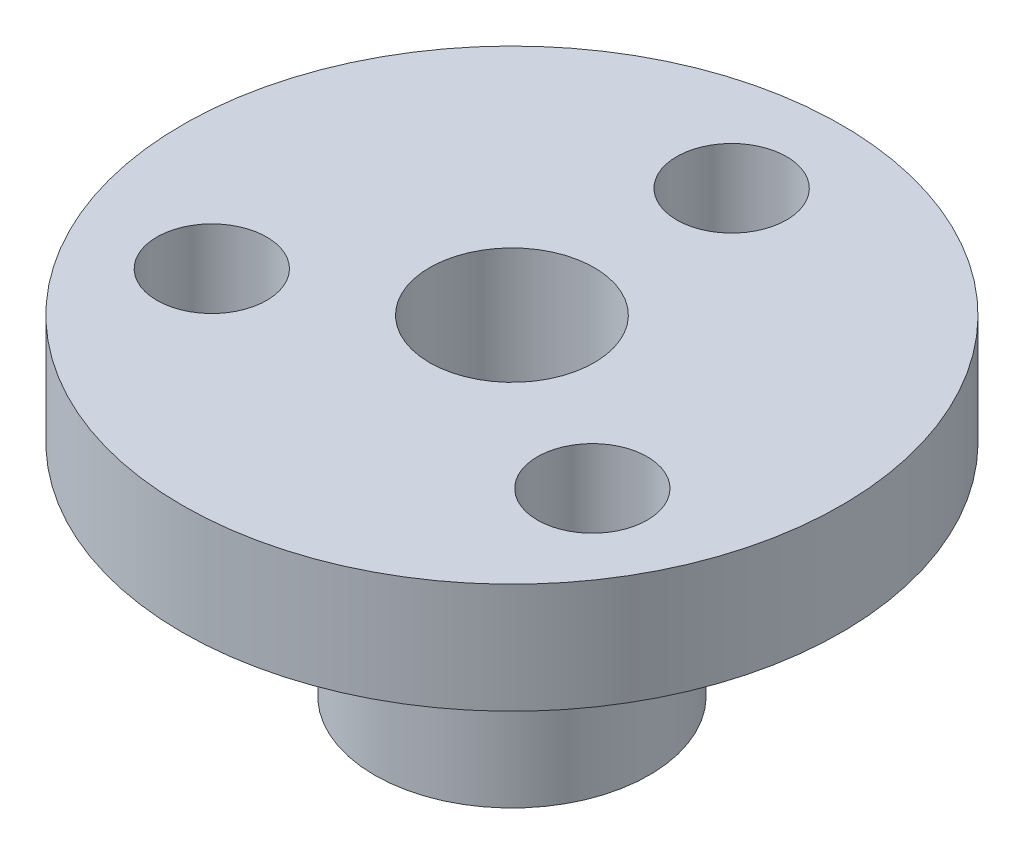
ISO-10303-21;
HEADER;
FILE_DESCRIPTION(('STEP AP214'),'2;1');
FILE_NAME('part.step','',(''),(''),'','','');
FILE_SCHEMA(('AUTOMOTIVE_DESIGN { 1 0 10303 214 1 1 1 1 }'));
ENDSEC;
DATA;
#1=APPLICATION_CONTEXT('core data for automotive mechanical design processes');
#2=APPLICATION_PROTOCOL_DEFINITION('international standard','automotive_design',2000,#1);
#3=PRODUCT_CONTEXT('',#1,'mechanical');
#4=PRODUCT('Part','Part','',(#3));
#5=PRODUCT_RELATED_PRODUCT_CATEGORY('part','',(#4));
#6=PRODUCT_DEFINITION_FORMATION('','',#4);
#7=PRODUCT_DEFINITION_CONTEXT('part definition',#1,'design');
#8=PRODUCT_DEFINITION('design','',#6,#7);
#9=PRODUCT_DEFINITION_SHAPE('','',#8);
#10=(LENGTH_UNIT() NAMED_UNIT(*) SI_UNIT(.MILLI.,.METRE.));
#11=(NAMED_UNIT(*) PLANE_ANGLE_UNIT() SI_UNIT($,.RADIAN.));
#12=(NAMED_UNIT(*) SI_UNIT($,.STERADIAN.) SOLID_ANGLE_UNIT());
#13=UNCERTAINTY_MEASURE_WITH_UNIT(LENGTH_MEASURE(1.E-05),#10,'distance_accuracy_value','');
#14=(GEOMETRIC_REPRESENTATION_CONTEXT(3) GLOBAL_UNCERTAINTY_ASSIGNED_CONTEXT((#13)) GLOBAL_UNIT_ASSIGNED_CONTEXT((#10,
#11,#12)) REPRESENTATION_CONTEXT('',''));
#15=CARTESIAN_POINT('',(0.,0.,0.));
#16=DIRECTION('',(0.,0.,1.));
#17=DIRECTION('',(1.,0.,0.));
#18=AXIS2_PLACEMENT_3D('',#15,#16,#17);
#19=CARTESIAN_POINT('',(0.,10.3404322573456,0.));
#20=DIRECTION('',(0.,1.,0.));
#21=DIRECTION('',(0.,0.,1.));
#22=AXIS2_PLACEMENT_3D('',#19,#20,#21);
#23=CYLINDRICAL_SURFACE('',#22,2.38);
#24=CARTESIAN_POINT('',(0.,0.,0.));
#25=DIRECTION('',(0.,1.,0.));
#26=DIRECTION('',(0.,0.,1.));
#27=AXIS2_PLACEMENT_3D('',#24,#25,#26);
#28=CIRCLE('',#27,2.38);
#29=CARTESIAN_POINT('',(0.,0.,2.38));
#30=VERTEX_POINT('',#29);
#31=EDGE_CURVE('E60',#30,#30,#28,.T.);
#32=ORIENTED_EDGE('',*,*,#31,.F.);
#33=EDGE_LOOP('',(#32));
#34=FACE_BOUND('',#33,.T.);
#35=CARTESIAN_POINT('',(0.,9.53,0.));
#36=DIRECTION('',(0.,1.,0.));
#37=DIRECTION('',(0.,0.,1.));
#38=AXIS2_PLACEMENT_3D('',#35,#36,#37);
#39=CIRCLE('',#38,2.38);
#40=CARTESIAN_POINT('',(0.,9.53,2.38));
#41=VERTEX_POINT('',#40);
#42=EDGE_CURVE('E10',#41,#41,#39,.T.);
#43=ORIENTED_EDGE('',*,*,#42,.T.);
#44=EDGE_LOOP('',(#43));
#45=FACE_BOUND('',#44,.T.);
#46=ADVANCED_FACE('F37',(#34,#45),#23,.F.);
#47=CARTESIAN_POINT('',(2.38,9.53,0.));
#48=DIRECTION('',(0.,-1.,0.));
#49=DIRECTION('',(0.,0.,-1.));
#50=AXIS2_PLACEMENT_3D('',#47,#48,#49);
#51=PLANE('',#50);
#52=CARTESIAN_POINT('',(-5.49926131403117,9.53,3.17500000000003));
#53=DIRECTION('',(0.,1.,0.));
#54=DIRECTION('',(0.866025403784436,0.,-0.500000000000004));
#55=AXIS2_PLACEMENT_3D('',#52,#53,#54);
#56=CIRCLE('',#55,1.5875);
#57=CARTESIAN_POINT('',(-4.12444598552338,9.53,2.38125000000002));
#58=VERTEX_POINT('',#57);
#59=EDGE_CURVE('E70',#58,#58,#56,.T.);
#60=ORIENTED_EDGE('',*,*,#59,.F.);
#61=EDGE_LOOP('',(#60));
#62=FACE_BOUND('',#61,.T.);
#63=CARTESIAN_POINT('',(5.49926131403121,9.53,3.17499999999995));
#64=DIRECTION('',(0.,1.,0.));
#65=DIRECTION('',(-0.866025403784443,0.,-0.499999999999992));
#66=AXIS2_PLACEMENT_3D('',#63,#64,#65);
#67=CIRCLE('',#66,1.5875);
#68=CARTESIAN_POINT('',(4.12444598552341,9.53,2.38124999999996));
#69=VERTEX_POINT('',#68);
#70=EDGE_CURVE('E71',#69,#69,#67,.T.);
#71=ORIENTED_EDGE('',*,*,#70,.F.);
#72=EDGE_LOOP('',(#71));
#73=FACE_BOUND('',#72,.T.);
#74=CARTESIAN_POINT('',(0.,9.53,-6.35));
#75=DIRECTION('',(0.,1.,0.));
#76=DIRECTION('',(0.,0.,1.));
#77=AXIS2_PLACEMENT_3D('',#74,#75,#76);
#78=CIRCLE('',#77,1.5875);
#79=CARTESIAN_POINT('',(0.,9.53,-4.7625));
#80=VERTEX_POINT('',#79);
#81=EDGE_CURVE('E63',#80,#80,#78,.T.);
#82=ORIENTED_EDGE('',*,*,#81,.F.);
#83=EDGE_LOOP('',(#82));
#84=FACE_BOUND('',#83,.T.);
#85=ORIENTED_EDGE('',*,*,#42,.F.);
#86=EDGE_LOOP('',(#85));
#87=FACE_BOUND('',#86,.T.);
#88=CARTESIAN_POINT('',(0.,9.53,0.));
#89=DIRECTION('',(0.,1.,0.));
#90=DIRECTION('',(0.,0.,1.));
#91=AXIS2_PLACEMENT_3D('',#88,#89,#90);
#92=CIRCLE('',#91,9.525);
#93=CARTESIAN_POINT('',(0.,9.53,9.525));
#94=VERTEX_POINT('',#93);
#95=EDGE_CURVE('E44',#94,#94,#92,.T.);
#96=ORIENTED_EDGE('',*,*,#95,.T.);
#97=EDGE_LOOP('',(#96));
#98=FACE_BOUND('',#97,.T.);
#99=ADVANCED_FACE('F82',(#62,#73,#84,#87,#98),#51,.F.);
#100=CARTESIAN_POINT('',(0.,10.3404322573456,0.));
#101=DIRECTION('',(0.,1.,0.));
#102=DIRECTION('',(0.,0.,1.));
#103=AXIS2_PLACEMENT_3D('',#100,#101,#102);
#104=CYLINDRICAL_SURFACE('',#103,9.525);
#105=ORIENTED_EDGE('',*,*,#95,.F.);
#106=EDGE_LOOP('',(#105));
#107=FACE_BOUND('',#106,.T.);
#108=CARTESIAN_POINT('',(0.,6.35,0.));
#109=DIRECTION('',(0.,1.,0.));
#110=DIRECTION('',(0.,0.,1.));
#111=AXIS2_PLACEMENT_3D('',#108,#109,#110);
#112=CIRCLE('',#111,9.525);
#113=CARTESIAN_POINT('',(0.,6.35,9.525));
#114=VERTEX_POINT('',#113);
#115=EDGE_CURVE('E48',#114,#114,#112,.T.);
#116=ORIENTED_EDGE('',*,*,#115,.T.);
#117=EDGE_LOOP('',(#116));
#118=FACE_BOUND('',#117,.T.);
#119=ADVANCED_FACE('F85',(#107,#118),#104,.T.);
#120=CARTESIAN_POINT('',(9.525,6.35,0.));
#121=DIRECTION('',(0.,1.,0.));
#122=DIRECTION('',(0.,0.,1.));
#123=AXIS2_PLACEMENT_3D('',#120,#121,#122);
#124=PLANE('',#123);
#125=CARTESIAN_POINT('',(-5.49926131403117,6.35,3.17500000000003));
#126=DIRECTION('',(0.,1.,0.));
#127=DIRECTION('',(0.866025403784436,0.,-0.500000000000004));
#128=AXIS2_PLACEMENT_3D('',#125,#126,#127);
#129=CIRCLE('',#128,1.5875);
#130=CARTESIAN_POINT('',(-4.12444598552338,6.35,2.38125000000002));
#131=VERTEX_POINT('',#130);
#132=EDGE_CURVE('E66',#131,#131,#129,.T.);
#133=ORIENTED_EDGE('',*,*,#132,.T.);
#134=EDGE_LOOP('',(#133));
#135=FACE_BOUND('',#134,.T.);
#136=CARTESIAN_POINT('',(5.49926131403121,6.35,3.17499999999995));
#137=DIRECTION('',(0.,1.,0.));
#138=DIRECTION('',(-0.866025403784443,0.,-0.499999999999992));
#139=AXIS2_PLACEMENT_3D('',#136,#137,#138);
#140=CIRCLE('',#139,1.5875);
#141=CARTESIAN_POINT('',(4.12444598552341,6.35,2.38124999999996));
#142=VERTEX_POINT('',#141);
#143=EDGE_CURVE('E67',#142,#142,#140,.T.);
#144=ORIENTED_EDGE('',*,*,#143,.T.);
#145=EDGE_LOOP('',(#144));
#146=FACE_BOUND('',#145,.T.);
#147=CARTESIAN_POINT('',(0.,6.35,-6.35));
#148=DIRECTION('',(0.,1.,0.));
#149=DIRECTION('',(0.,0.,1.));
#150=AXIS2_PLACEMENT_3D('',#147,#148,#149);
#151=CIRCLE('',#150,1.5875);
#152=CARTESIAN_POINT('',(0.,6.35,-4.7625));
#153=VERTEX_POINT('',#152);
#154=EDGE_CURVE('E40',#153,#153,#151,.T.);
#155=ORIENTED_EDGE('',*,*,#154,.T.);
#156=EDGE_LOOP('',(#155));
#157=FACE_BOUND('',#156,.T.);
#158=ORIENTED_EDGE('',*,*,#115,.F.);
#159=EDGE_LOOP('',(#158));
#160=FACE_BOUND('',#159,.T.);
#161=CARTESIAN_POINT('',(0.,6.35,0.));
#162=DIRECTION('',(0.,1.,0.));
#163=DIRECTION('',(0.,0.,1.));
#164=AXIS2_PLACEMENT_3D('',#161,#162,#163);
#165=CIRCLE('',#164,3.97);
#166=CARTESIAN_POINT('',(0.,6.35,3.97));
#167=VERTEX_POINT('',#166);
#168=EDGE_CURVE('E54',#167,#167,#165,.T.);
#169=ORIENTED_EDGE('',*,*,#168,.T.);
#170=EDGE_LOOP('',(#169));
#171=FACE_BOUND('',#170,.T.);
#172=ADVANCED_FACE('F95',(#135,#146,#157,#160,#171),#124,.F.);
#173=CARTESIAN_POINT('',(0.,10.3404322573456,0.));
#174=DIRECTION('',(0.,1.,0.));
#175=DIRECTION('',(0.,0.,1.));
#176=AXIS2_PLACEMENT_3D('',#173,#174,#175);
#177=CYLINDRICAL_SURFACE('',#176,3.97);
#178=ORIENTED_EDGE('',*,*,#168,.F.);
#179=EDGE_LOOP('',(#178));
#180=FACE_BOUND('',#179,.T.);
#181=CARTESIAN_POINT('',(0.,0.,0.));
#182=DIRECTION('',(0.,1.,0.));
#183=DIRECTION('',(0.,0.,1.));
#184=AXIS2_PLACEMENT_3D('',#181,#182,#183);
#185=CIRCLE('',#184,3.97);
#186=CARTESIAN_POINT('',(0.,0.,3.97));
#187=VERTEX_POINT('',#186);
#188=EDGE_CURVE('E57',#187,#187,#185,.T.);
#189=ORIENTED_EDGE('',*,*,#188,.T.);
#190=EDGE_LOOP('',(#189));
#191=FACE_BOUND('',#190,.T.);
#192=ADVANCED_FACE('F101',(#180,#191),#177,.T.);
#193=CARTESIAN_POINT('',(3.97,0.,0.));
#194=DIRECTION('',(0.,1.,0.));
#195=DIRECTION('',(0.,0.,1.));
#196=AXIS2_PLACEMENT_3D('',#193,#194,#195);
#197=PLANE('',#196);
#198=ORIENTED_EDGE('',*,*,#188,.F.);
#199=EDGE_LOOP('',(#198));
#200=FACE_BOUND('',#199,.T.);
#201=ORIENTED_EDGE('',*,*,#31,.T.);
#202=EDGE_LOOP('',(#201));
#203=FACE_BOUND('',#202,.T.);
#204=ADVANCED_FACE('F108',(#200,#203),#197,.F.);
#205=CARTESIAN_POINT('',(0.,0.,-6.35));
#206=DIRECTION('',(0.,1.,0.));
#207=DIRECTION('',(0.,0.,1.));
#208=AXIS2_PLACEMENT_3D('',#205,#206,#207);
#209=CYLINDRICAL_SURFACE('',#208,1.5875);
#210=ORIENTED_EDGE('',*,*,#81,.T.);
#211=EDGE_LOOP('',(#210));
#212=FACE_BOUND('',#211,.T.);
#213=ORIENTED_EDGE('',*,*,#154,.F.);
#214=EDGE_LOOP('',(#213));
#215=FACE_BOUND('',#214,.T.);
#216=ADVANCED_FACE('F114',(#212,#215),#209,.F.);
#217=CARTESIAN_POINT('',(5.49926131403121,0.,3.17499999999995));
#218=DIRECTION('',(0.,1.,0.));
#219=DIRECTION('',(-0.866025403784443,0.,-0.499999999999992));
#220=AXIS2_PLACEMENT_3D('',#217,#218,#219);
#221=CYLINDRICAL_SURFACE('',#220,1.5875);
#222=ORIENTED_EDGE('',*,*,#70,.T.);
#223=EDGE_LOOP('',(#222));
#224=FACE_BOUND('',#223,.T.);
#225=ORIENTED_EDGE('',*,*,#143,.F.);
#226=EDGE_LOOP('',(#225));
#227=FACE_BOUND('',#226,.T.);
#228=ADVANCED_FACE('F146',(#224,#227),#221,.F.);
#229=CARTESIAN_POINT('',(-5.49926131403117,0.,3.17500000000003));
#230=DIRECTION('',(0.,1.,0.));
#231=DIRECTION('',(0.866025403784436,0.,-0.500000000000004));
#232=AXIS2_PLACEMENT_3D('',#229,#230,#231);
#233=CYLINDRICAL_SURFACE('',#232,1.5875);
#234=ORIENTED_EDGE('',*,*,#59,.T.);
#235=EDGE_LOOP('',(#234));
#236=FACE_BOUND('',#235,.T.);
#237=ORIENTED_EDGE('',*,*,#132,.F.);
#238=EDGE_LOOP('',(#237));
#239=FACE_BOUND('',#238,.T.);
#240=ADVANCED_FACE('F79',(#236,#239),#233,.F.);
#241=CLOSED_SHELL('',(#46,#99,#119,#172,#192,#204,#216,#228,#240));
#242=MANIFOLD_SOLID_BREP('B2',#241);
#243=ADVANCED_BREP_SHAPE_REPRESENTATION('',(#18,#242),#14);
#244=SHAPE_DEFINITION_REPRESENTATION(#9,#243);
ENDSEC;
END-ISO-10303-21;
